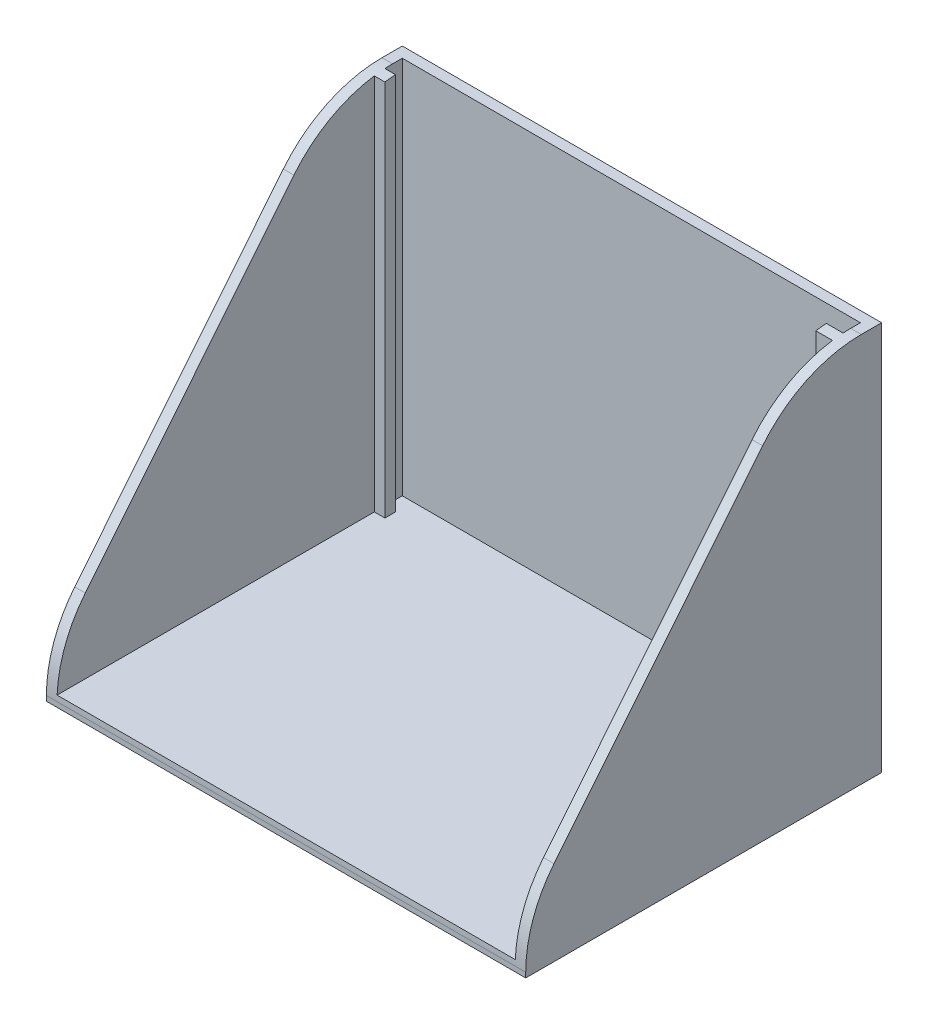
ISO-10303-21;
HEADER;
FILE_DESCRIPTION(('STEP AP214'),'2;1');
FILE_NAME('part.step','',(''),(''),'','','');
FILE_SCHEMA(('AUTOMOTIVE_DESIGN { 1 0 10303 214 1 1 1 1 }'));
ENDSEC;
DATA;
#1=APPLICATION_CONTEXT('core data for automotive mechanical design processes');
#2=APPLICATION_PROTOCOL_DEFINITION('international standard','automotive_design',2000,#1);
#3=PRODUCT_CONTEXT('',#1,'mechanical');
#4=PRODUCT('Part','Part','',(#3));
#5=PRODUCT_RELATED_PRODUCT_CATEGORY('part','',(#4));
#6=PRODUCT_DEFINITION_FORMATION('','',#4);
#7=PRODUCT_DEFINITION_CONTEXT('part definition',#1,'design');
#8=PRODUCT_DEFINITION('design','',#6,#7);
#9=PRODUCT_DEFINITION_SHAPE('','',#8);
#10=(LENGTH_UNIT() NAMED_UNIT(*) SI_UNIT(.MILLI.,.METRE.));
#11=(NAMED_UNIT(*) PLANE_ANGLE_UNIT() SI_UNIT($,.RADIAN.));
#12=(NAMED_UNIT(*) SI_UNIT($,.STERADIAN.) SOLID_ANGLE_UNIT());
#13=UNCERTAINTY_MEASURE_WITH_UNIT(LENGTH_MEASURE(1.E-05),#10,'distance_accuracy_value','');
#14=(GEOMETRIC_REPRESENTATION_CONTEXT(3) GLOBAL_UNCERTAINTY_ASSIGNED_CONTEXT((#13)) GLOBAL_UNIT_ASSIGNED_CONTEXT((#10,
#11,#12)) REPRESENTATION_CONTEXT('',''));
#15=CARTESIAN_POINT('',(0.,0.,0.));
#16=DIRECTION('',(0.,0.,1.));
#17=DIRECTION('',(1.,0.,0.));
#18=AXIS2_PLACEMENT_3D('',#15,#16,#17);
#19=CARTESIAN_POINT('',(163.524,-109.181799526008,3.104));
#20=DIRECTION('',(0.,0.,1.));
#21=DIRECTION('',(1.,0.,0.));
#22=AXIS2_PLACEMENT_3D('',#19,#20,#21);
#23=PLANE('',#22);
#24=DIRECTION('',(0.,-1.,0.));
#25=VECTOR('',#24,1.);
#26=CARTESIAN_POINT('',(108.516,-109.181799526008,3.104));
#27=LINE('',#26,#25);
#28=CARTESIAN_POINT('',(108.516,-109.33984308712,3.104));
#29=VERTEX_POINT('',#28);
#30=CARTESIAN_POINT('',(108.516,-154.681799526008,3.104));
#31=VERTEX_POINT('',#30);
#32=EDGE_CURVE('E273',#29,#31,#27,.T.);
#33=ORIENTED_EDGE('',*,*,#32,.F.);
#34=DIRECTION('',(1.,0.,0.));
#35=VECTOR('',#34,1.);
#36=CARTESIAN_POINT('',(108.516,-109.33984308712,3.104));
#37=LINE('',#36,#35);
#38=CARTESIAN_POINT('',(107.246,-109.33984308712,3.10399999999998));
#39=VERTEX_POINT('',#38);
#40=EDGE_CURVE('E316',#29,#39,#37,.F.);
#41=ORIENTED_EDGE('',*,*,#40,.T.);
#42=DIRECTION('',(0.,1.,0.));
#43=VECTOR('',#42,1.);
#44=CARTESIAN_POINT('',(107.246,-109.181799526008,3.10399999999998));
#45=LINE('',#44,#43);
#46=CARTESIAN_POINT('',(107.246,-154.681799526008,3.10399999999998));
#47=VERTEX_POINT('',#46);
#48=EDGE_CURVE('E189',#47,#39,#45,.T.);
#49=ORIENTED_EDGE('',*,*,#48,.F.);
#50=DIRECTION('',(-1.,0.,0.));
#51=VECTOR('',#50,1.);
#52=CARTESIAN_POINT('',(107.246,-154.681799526008,3.10399999999998));
#53=LINE('',#52,#51);
#54=EDGE_CURVE('E216',#31,#47,#53,.T.);
#55=ORIENTED_EDGE('',*,*,#54,.F.);
#56=EDGE_LOOP('',(#33,#41,#49,#55));
#57=FACE_BOUND('',#56,.T.);
#58=ADVANCED_FACE('F39',(#57),#23,.T.);
#59=CARTESIAN_POINT('',(162.254,-109.181799526008,-0.254));
#60=DIRECTION('',(0.,0.,1.));
#61=DIRECTION('',(1.,0.,0.));
#62=AXIS2_PLACEMENT_3D('',#59,#60,#61);
#63=PLANE('',#62);
#64=DIRECTION('',(-1.,0.,0.));
#65=VECTOR('',#64,1.);
#66=CARTESIAN_POINT('',(162.254,-154.681799526008,-0.254));
#67=LINE('',#66,#65);
#68=CARTESIAN_POINT('',(162.254,-154.681799526008,-0.254));
#69=VERTEX_POINT('',#68);
#70=CARTESIAN_POINT('',(107.246,-154.681799526008,-0.254));
#71=VERTEX_POINT('',#70);
#72=EDGE_CURVE('E228',#69,#71,#67,.T.);
#73=ORIENTED_EDGE('',*,*,#72,.F.);
#74=DIRECTION('',(0.,-1.,0.));
#75=VECTOR('',#74,1.);
#76=CARTESIAN_POINT('',(162.254,-109.181799526008,-0.254));
#77=LINE('',#76,#75);
#78=CARTESIAN_POINT('',(162.254,-109.181799526008,-0.254));
#79=VERTEX_POINT('',#78);
#80=EDGE_CURVE('E261',#79,#69,#77,.T.);
#81=ORIENTED_EDGE('',*,*,#80,.F.);
#82=DIRECTION('',(-1.,0.,0.));
#83=VECTOR('',#82,1.);
#84=CARTESIAN_POINT('',(107.246,-109.181799526008,-0.254));
#85=LINE('',#84,#83);
#86=CARTESIAN_POINT('',(107.246,-109.181799526008,-0.254));
#87=VERTEX_POINT('',#86);
#88=EDGE_CURVE('E224',#79,#87,#85,.T.);
#89=ORIENTED_EDGE('',*,*,#88,.T.);
#90=DIRECTION('',(0.,-1.,0.));
#91=VECTOR('',#90,1.);
#92=CARTESIAN_POINT('',(107.246,-109.181799526008,-0.254));
#93=LINE('',#92,#91);
#94=EDGE_CURVE('E241',#87,#71,#93,.T.);
#95=ORIENTED_EDGE('',*,*,#94,.T.);
#96=EDGE_LOOP('',(#73,#81,#89,#95));
#97=FACE_BOUND('',#96,.T.);
#98=ADVANCED_FACE('F384',(#97),#63,.T.);
#99=CARTESIAN_POINT('',(162.254,-109.181799526008,1.834));
#100=DIRECTION('',(-1.,0.,0.));
#101=DIRECTION('',(0.,-1.,0.));
#102=AXIS2_PLACEMENT_3D('',#99,#100,#101);
#103=PLANE('',#102);
#104=DIRECTION('',(0.,-1.,0.));
#105=VECTOR('',#104,1.);
#106=CARTESIAN_POINT('',(162.254,-109.181799526008,1.834));
#107=LINE('',#106,#105);
#108=CARTESIAN_POINT('',(162.254,-109.209539927084,1.834));
#109=VERTEX_POINT('',#108);
#110=CARTESIAN_POINT('',(162.254,-154.681799526008,1.834));
#111=VERTEX_POINT('',#110);
#112=EDGE_CURVE('E264',#109,#111,#107,.T.);
#113=ORIENTED_EDGE('',*,*,#112,.F.);
#114=CARTESIAN_POINT('',(162.254,-124.421799526008,0.914892881679948));
#115=DIRECTION('',(-1.,0.,0.));
#116=DIRECTION('',(0.,-1.,0.));
#117=AXIS2_PLACEMENT_3D('',#114,#115,#116);
#118=CIRCLE('',#117,15.24);
#119=CARTESIAN_POINT('',(162.254,-109.181799526008,0.914892881679948));
#120=VERTEX_POINT('',#119);
#121=EDGE_CURVE('E308',#109,#120,#118,.T.);
#122=ORIENTED_EDGE('',*,*,#121,.T.);
#123=DIRECTION('',(0.,0.,-1.));
#124=VECTOR('',#123,1.);
#125=CARTESIAN_POINT('',(162.254,-109.181799526008,1.834));
#126=LINE('',#125,#124);
#127=EDGE_CURVE('E239',#120,#79,#126,.T.);
#128=ORIENTED_EDGE('',*,*,#127,.T.);
#129=ORIENTED_EDGE('',*,*,#80,.T.);
#130=DIRECTION('',(0.,0.,-1.));
#131=VECTOR('',#130,1.);
#132=CARTESIAN_POINT('',(162.254,-154.681799526008,1.834));
#133=LINE('',#132,#131);
#134=EDGE_CURVE('E256',#111,#69,#133,.T.);
#135=ORIENTED_EDGE('',*,*,#134,.F.);
#136=EDGE_LOOP('',(#113,#122,#128,#129,#135));
#137=FACE_BOUND('',#136,.T.);
#138=ADVANCED_FACE('F388',(#137),#103,.T.);
#139=CARTESIAN_POINT('',(160.252914004423,-109.181799526008,1.834));
#140=DIRECTION('',(0.,0.,-1.));
#141=DIRECTION('',(-1.,0.,0.));
#142=AXIS2_PLACEMENT_3D('',#139,#140,#141);
#143=PLANE('',#142);
#144=DIRECTION('',(0.,-1.,0.));
#145=VECTOR('',#144,1.);
#146=CARTESIAN_POINT('',(160.252914004423,-109.181799526008,1.834));
#147=LINE('',#146,#145);
#148=CARTESIAN_POINT('',(160.252914004423,-109.209539927084,1.834));
#149=VERTEX_POINT('',#148);
#150=CARTESIAN_POINT('',(160.252914004423,-154.681799526008,1.834));
#151=VERTEX_POINT('',#150);
#152=EDGE_CURVE('E266',#149,#151,#147,.T.);
#153=ORIENTED_EDGE('',*,*,#152,.F.);
#154=DIRECTION('',(1.,0.,0.));
#155=VECTOR('',#154,1.);
#156=CARTESIAN_POINT('',(160.252914004423,-109.209539927084,1.834));
#157=LINE('',#156,#155);
#158=EDGE_CURVE('E306',#149,#109,#157,.T.);
#159=ORIENTED_EDGE('',*,*,#158,.T.);
#160=ORIENTED_EDGE('',*,*,#112,.T.);
#161=DIRECTION('',(1.,0.,0.));
#162=VECTOR('',#161,1.);
#163=CARTESIAN_POINT('',(160.252914004423,-154.681799526008,1.834));
#164=LINE('',#163,#162);
#165=EDGE_CURVE('E253',#151,#111,#164,.T.);
#166=ORIENTED_EDGE('',*,*,#165,.F.);
#167=EDGE_LOOP('',(#153,#159,#160,#166));
#168=FACE_BOUND('',#167,.T.);
#169=ADVANCED_FACE('F393',(#168),#143,.T.);
#170=CARTESIAN_POINT('',(160.252914004423,-109.181799526008,3.104));
#171=DIRECTION('',(-1.,0.,0.));
#172=DIRECTION('',(0.,-1.,0.));
#173=AXIS2_PLACEMENT_3D('',#170,#171,#172);
#174=PLANE('',#173);
#175=DIRECTION('',(0.,-1.,0.));
#176=VECTOR('',#175,1.);
#177=CARTESIAN_POINT('',(160.252914004423,-109.181799526008,3.104));
#178=LINE('',#177,#176);
#179=CARTESIAN_POINT('',(160.252914004423,-109.33984308712,3.104));
#180=VERTEX_POINT('',#179);
#181=CARTESIAN_POINT('',(160.252914004423,-154.681799526008,3.104));
#182=VERTEX_POINT('',#181);
#183=EDGE_CURVE('E268',#180,#182,#178,.T.);
#184=ORIENTED_EDGE('',*,*,#183,.F.);
#185=CARTESIAN_POINT('',(160.252914004423,-124.421799526008,0.914892881679948));
#186=DIRECTION('',(-1.,0.,0.));
#187=DIRECTION('',(0.,-1.,0.));
#188=AXIS2_PLACEMENT_3D('',#185,#186,#187);
#189=CIRCLE('',#188,15.24);
#190=EDGE_CURVE('E304',#180,#149,#189,.T.);
#191=ORIENTED_EDGE('',*,*,#190,.T.);
#192=ORIENTED_EDGE('',*,*,#152,.T.);
#193=DIRECTION('',(0.,0.,-1.));
#194=VECTOR('',#193,1.);
#195=CARTESIAN_POINT('',(160.252914004423,-154.681799526008,3.104));
#196=LINE('',#195,#194);
#197=EDGE_CURVE('E250',#182,#151,#196,.T.);
#198=ORIENTED_EDGE('',*,*,#197,.F.);
#199=EDGE_LOOP('',(#184,#191,#192,#198));
#200=FACE_BOUND('',#199,.T.);
#201=ADVANCED_FACE('F422',(#200),#174,.T.);
#202=DIRECTION('',(0.,-1.,0.));
#203=VECTOR('',#202,1.);
#204=CARTESIAN_POINT('',(162.254,-154.681799526008,3.10399999999998));
#205=LINE('',#204,#203);
#206=CARTESIAN_POINT('',(162.254,-109.33984308712,3.10399999999998));
#207=VERTEX_POINT('',#206);
#208=CARTESIAN_POINT('',(162.254,-154.681799526008,3.10399999999998));
#209=VERTEX_POINT('',#208);
#210=EDGE_CURVE('E210',#207,#209,#205,.T.);
#211=ORIENTED_EDGE('',*,*,#210,.F.);
#212=DIRECTION('',(1.,0.,0.));
#213=VECTOR('',#212,1.);
#214=CARTESIAN_POINT('',(162.254,-109.33984308712,3.10399999999998));
#215=LINE('',#214,#213);
#216=EDGE_CURVE('E302',#207,#180,#215,.F.);
#217=ORIENTED_EDGE('',*,*,#216,.T.);
#218=ORIENTED_EDGE('',*,*,#183,.T.);
#219=EDGE_CURVE('E213',#209,#182,#53,.T.);
#220=ORIENTED_EDGE('',*,*,#219,.F.);
#221=EDGE_LOOP('',(#211,#217,#218,#220));
#222=FACE_BOUND('',#221,.T.);
#223=ADVANCED_FACE('F412',(#222),#23,.T.);
#224=CARTESIAN_POINT('',(163.524,-109.181799526008,-1.524));
#225=DIRECTION('',(1.,0.,0.));
#226=DIRECTION('',(0.,1.,0.));
#227=AXIS2_PLACEMENT_3D('',#224,#225,#226);
#228=PLANE('',#227);
#229=DIRECTION('',(0.,-0.77714596145697,0.629320391049839));
#230=VECTOR('',#229,1.);
#231=CARTESIAN_POINT('',(163.524,-104.433871072046,4.33920334722932));
#232=LINE('',#231,#230);
#233=CARTESIAN_POINT('',(163.524,-114.830956766408,12.7585973342842));
#234=VERTEX_POINT('',#233);
#235=CARTESIAN_POINT('',(163.524,-145.764027920563,37.8077044526042));
#236=VERTEX_POINT('',#235);
#237=EDGE_CURVE('E282',#234,#236,#232,.T.);
#238=ORIENTED_EDGE('',*,*,#237,.T.);
#239=CARTESIAN_POINT('',(163.524,-155.354870680163,25.964));
#240=DIRECTION('',(1.,0.,0.));
#241=DIRECTION('',(0.,1.,0.));
#242=AXIS2_PLACEMENT_3D('',#239,#240,#241);
#243=CIRCLE('',#242,15.24);
#244=CARTESIAN_POINT('',(163.524,-155.354870680163,41.204));
#245=VERTEX_POINT('',#244);
#246=EDGE_CURVE('E332',#236,#245,#243,.T.);
#247=ORIENTED_EDGE('',*,*,#246,.T.);
#248=DIRECTION('',(0.,1.,0.));
#249=VECTOR('',#248,1.);
#250=CARTESIAN_POINT('',(163.524,-109.181799526008,41.204));
#251=LINE('',#250,#249);
#252=CARTESIAN_POINT('',(163.524,-155.951799526008,41.204));
#253=VERTEX_POINT('',#252);
#254=EDGE_CURVE('E205',#253,#245,#251,.T.);
#255=ORIENTED_EDGE('',*,*,#254,.F.);
#256=DIRECTION('',(0.,0.,1.));
#257=VECTOR('',#256,1.);
#258=CARTESIAN_POINT('',(163.524,-155.951799526008,3.104));
#259=LINE('',#258,#257);
#260=CARTESIAN_POINT('',(163.524,-155.951799526008,-1.524));
#261=VERTEX_POINT('',#260);
#262=EDGE_CURVE('E204',#261,#253,#259,.T.);
#263=ORIENTED_EDGE('',*,*,#262,.F.);
#264=DIRECTION('',(0.,-1.,0.));
#265=VECTOR('',#264,1.);
#266=CARTESIAN_POINT('',(163.524,-109.181799526008,-1.524));
#267=LINE('',#266,#265);
#268=CARTESIAN_POINT('',(163.524,-109.181799526008,-1.524));
#269=VERTEX_POINT('',#268);
#270=EDGE_CURVE('E270',#269,#261,#267,.T.);
#271=ORIENTED_EDGE('',*,*,#270,.F.);
#272=DIRECTION('',(0.,0.,1.));
#273=VECTOR('',#272,1.);
#274=CARTESIAN_POINT('',(163.524,-109.181799526008,-1.524));
#275=LINE('',#274,#273);
#276=CARTESIAN_POINT('',(163.524,-109.181799526008,0.914892881679948));
#277=VERTEX_POINT('',#276);
#278=EDGE_CURVE('E236',#269,#277,#275,.T.);
#279=ORIENTED_EDGE('',*,*,#278,.T.);
#280=CARTESIAN_POINT('',(163.524,-124.421799526008,0.914892881679948));
#281=DIRECTION('',(1.,0.,0.));
#282=DIRECTION('',(0.,1.,0.));
#283=AXIS2_PLACEMENT_3D('',#280,#281,#282);
#284=CIRCLE('',#283,15.24);
#285=EDGE_CURVE('E295',#277,#234,#284,.T.);
#286=ORIENTED_EDGE('',*,*,#285,.T.);
#287=EDGE_LOOP('',(#238,#247,#255,#263,#271,#279,#286));
#288=FACE_BOUND('',#287,.T.);
#289=ADVANCED_FACE('F337',(#288),#228,.T.);
#290=CARTESIAN_POINT('',(163.524,-109.181799526008,-1.524));
#291=DIRECTION('',(0.,0.,-1.));
#292=DIRECTION('',(-1.,0.,0.));
#293=AXIS2_PLACEMENT_3D('',#290,#291,#292);
#294=PLANE('',#293);
#295=ORIENTED_EDGE('',*,*,#270,.T.);
#296=DIRECTION('',(1.,0.,0.));
#297=VECTOR('',#296,1.);
#298=CARTESIAN_POINT('',(105.976,-155.951799526008,-1.524));
#299=LINE('',#298,#297);
#300=CARTESIAN_POINT('',(105.976,-155.951799526008,-1.524));
#301=VERTEX_POINT('',#300);
#302=EDGE_CURVE('E199',#301,#261,#299,.T.);
#303=ORIENTED_EDGE('',*,*,#302,.F.);
#304=DIRECTION('',(0.,-1.,0.));
#305=VECTOR('',#304,1.);
#306=CARTESIAN_POINT('',(105.976,-109.181799526008,-1.52400000000001));
#307=LINE('',#306,#305);
#308=CARTESIAN_POINT('',(105.976,-109.181799526008,-1.52400000000001));
#309=VERTEX_POINT('',#308);
#310=EDGE_CURVE('E195',#309,#301,#307,.T.);
#311=ORIENTED_EDGE('',*,*,#310,.F.);
#312=DIRECTION('',(1.,0.,0.));
#313=VECTOR('',#312,1.);
#314=CARTESIAN_POINT('',(163.524,-109.181799526008,-1.524));
#315=LINE('',#314,#313);
#316=EDGE_CURVE('E233',#309,#269,#315,.T.);
#317=ORIENTED_EDGE('',*,*,#316,.T.);
#318=EDGE_LOOP('',(#295,#303,#311,#317));
#319=FACE_BOUND('',#318,.T.);
#320=ADVANCED_FACE('F403',(#319),#294,.T.);
#321=CARTESIAN_POINT('',(105.976,-109.181799526008,-1.52400000000001));
#322=DIRECTION('',(-1.,0.,0.));
#323=DIRECTION('',(0.,-1.,0.));
#324=AXIS2_PLACEMENT_3D('',#321,#322,#323);
#325=PLANE('',#324);
#326=DIRECTION('',(0.,-1.,0.));
#327=VECTOR('',#326,1.);
#328=CARTESIAN_POINT('',(105.976,-155.951799526008,41.204));
#329=LINE('',#328,#327);
#330=CARTESIAN_POINT('',(105.976,-155.354870680163,41.204));
#331=VERTEX_POINT('',#330);
#332=CARTESIAN_POINT('',(105.976,-155.951799526008,41.204));
#333=VERTEX_POINT('',#332);
#334=EDGE_CURVE('E181',#331,#333,#329,.T.);
#335=ORIENTED_EDGE('',*,*,#334,.F.);
#336=CARTESIAN_POINT('',(105.976,-155.354870680163,25.964));
#337=DIRECTION('',(-1.,0.,0.));
#338=DIRECTION('',(0.,-1.,0.));
#339=AXIS2_PLACEMENT_3D('',#336,#337,#338);
#340=CIRCLE('',#339,15.24);
#341=CARTESIAN_POINT('',(105.976,-145.764027920564,37.8077044526042));
#342=VERTEX_POINT('',#341);
#343=EDGE_CURVE('E61',#331,#342,#340,.T.);
#344=ORIENTED_EDGE('',*,*,#343,.T.);
#345=DIRECTION('',(0.,0.77714596145697,-0.629320391049839));
#346=VECTOR('',#345,1.);
#347=CARTESIAN_POINT('',(105.976,-104.433871072046,4.33920334722933));
#348=LINE('',#347,#346);
#349=CARTESIAN_POINT('',(105.976,-114.830956766408,12.7585973342842));
#350=VERTEX_POINT('',#349);
#351=EDGE_CURVE('E285',#342,#350,#348,.T.);
#352=ORIENTED_EDGE('',*,*,#351,.T.);
#353=CARTESIAN_POINT('',(105.976,-124.421799526008,0.914892881679953));
#354=DIRECTION('',(-1.,0.,0.));
#355=DIRECTION('',(0.,-1.,0.));
#356=AXIS2_PLACEMENT_3D('',#353,#354,#355);
#357=CIRCLE('',#356,15.24);
#358=CARTESIAN_POINT('',(105.976,-109.181799526008,0.914892881679953));
#359=VERTEX_POINT('',#358);
#360=EDGE_CURVE('E323',#350,#359,#357,.T.);
#361=ORIENTED_EDGE('',*,*,#360,.T.);
#362=DIRECTION('',(0.,0.,-1.));
#363=VECTOR('',#362,1.);
#364=CARTESIAN_POINT('',(105.976,-109.181799526008,-1.52400000000001));
#365=LINE('',#364,#363);
#366=EDGE_CURVE('E231',#359,#309,#365,.T.);
#367=ORIENTED_EDGE('',*,*,#366,.T.);
#368=ORIENTED_EDGE('',*,*,#310,.T.);
#369=DIRECTION('',(0.,0.,-1.));
#370=VECTOR('',#369,1.);
#371=CARTESIAN_POINT('',(105.976,-155.951799526008,3.104));
#372=LINE('',#371,#370);
#373=EDGE_CURVE('E192',#333,#301,#372,.T.);
#374=ORIENTED_EDGE('',*,*,#373,.F.);
#375=EDGE_LOOP('',(#335,#344,#352,#361,#367,#368,#374));
#376=FACE_BOUND('',#375,.T.);
#377=ADVANCED_FACE('F193',(#376),#325,.T.);
#378=CARTESIAN_POINT('',(108.516,-109.181799526008,3.104));
#379=DIRECTION('',(1.,0.,0.));
#380=DIRECTION('',(0.,1.,0.));
#381=AXIS2_PLACEMENT_3D('',#378,#379,#380);
#382=PLANE('',#381);
#383=DIRECTION('',(0.,-1.,0.));
#384=VECTOR('',#383,1.);
#385=CARTESIAN_POINT('',(108.516,-109.181799526008,1.834));
#386=LINE('',#385,#384);
#387=CARTESIAN_POINT('',(108.516,-109.209539927084,1.834));
#388=VERTEX_POINT('',#387);
#389=CARTESIAN_POINT('',(108.516,-154.681799526008,1.834));
#390=VERTEX_POINT('',#389);
#391=EDGE_CURVE('E275',#388,#390,#386,.T.);
#392=ORIENTED_EDGE('',*,*,#391,.F.);
#393=CARTESIAN_POINT('',(108.516,-124.421799526008,0.914892881679953));
#394=DIRECTION('',(1.,0.,0.));
#395=DIRECTION('',(0.,1.,0.));
#396=AXIS2_PLACEMENT_3D('',#393,#394,#395);
#397=CIRCLE('',#396,15.24);
#398=EDGE_CURVE('E314',#388,#29,#397,.T.);
#399=ORIENTED_EDGE('',*,*,#398,.T.);
#400=ORIENTED_EDGE('',*,*,#32,.T.);
#401=DIRECTION('',(0.,0.,1.));
#402=VECTOR('',#401,1.);
#403=CARTESIAN_POINT('',(108.516,-154.681799526008,3.104));
#404=LINE('',#403,#402);
#405=EDGE_CURVE('E247',#390,#31,#404,.T.);
#406=ORIENTED_EDGE('',*,*,#405,.F.);
#407=EDGE_LOOP('',(#392,#399,#400,#406));
#408=FACE_BOUND('',#407,.T.);
#409=ADVANCED_FACE('F410',(#408),#382,.T.);
#410=CARTESIAN_POINT('',(108.516,-109.181799526008,1.834));
#411=DIRECTION('',(0.,0.,-1.));
#412=DIRECTION('',(-1.,0.,0.));
#413=AXIS2_PLACEMENT_3D('',#410,#411,#412);
#414=PLANE('',#413);
#415=DIRECTION('',(0.,-1.,0.));
#416=VECTOR('',#415,1.);
#417=CARTESIAN_POINT('',(107.246,-109.181799526008,1.834));
#418=LINE('',#417,#416);
#419=CARTESIAN_POINT('',(107.246,-109.209539927084,1.834));
#420=VERTEX_POINT('',#419);
#421=CARTESIAN_POINT('',(107.246,-154.681799526008,1.834));
#422=VERTEX_POINT('',#421);
#423=EDGE_CURVE('E277',#420,#422,#418,.T.);
#424=ORIENTED_EDGE('',*,*,#423,.F.);
#425=DIRECTION('',(1.,0.,0.));
#426=VECTOR('',#425,1.);
#427=CARTESIAN_POINT('',(107.246,-109.209539927084,1.834));
#428=LINE('',#427,#426);
#429=EDGE_CURVE('E312',#420,#388,#428,.T.);
#430=ORIENTED_EDGE('',*,*,#429,.T.);
#431=ORIENTED_EDGE('',*,*,#391,.T.);
#432=DIRECTION('',(1.,0.,0.));
#433=VECTOR('',#432,1.);
#434=CARTESIAN_POINT('',(108.516,-154.681799526008,1.834));
#435=LINE('',#434,#433);
#436=EDGE_CURVE('E244',#422,#390,#435,.T.);
#437=ORIENTED_EDGE('',*,*,#436,.F.);
#438=EDGE_LOOP('',(#424,#430,#431,#437));
#439=FACE_BOUND('',#438,.T.);
#440=ADVANCED_FACE('F379',(#439),#414,.T.);
#441=CARTESIAN_POINT('',(107.246,-109.181799526008,1.834));
#442=DIRECTION('',(1.,0.,0.));
#443=DIRECTION('',(0.,1.,0.));
#444=AXIS2_PLACEMENT_3D('',#441,#442,#443);
#445=PLANE('',#444);
#446=DIRECTION('',(0.,0.,1.));
#447=VECTOR('',#446,1.);
#448=CARTESIAN_POINT('',(107.246,-109.181799526008,1.834));
#449=LINE('',#448,#447);
#450=CARTESIAN_POINT('',(107.246,-109.181799526008,0.914892881679953));
#451=VERTEX_POINT('',#450);
#452=EDGE_CURVE('E227',#87,#451,#449,.T.);
#453=ORIENTED_EDGE('',*,*,#452,.T.);
#454=CARTESIAN_POINT('',(107.246,-124.421799526008,0.914892881679953));
#455=DIRECTION('',(1.,0.,0.));
#456=DIRECTION('',(0.,1.,0.));
#457=AXIS2_PLACEMENT_3D('',#454,#455,#456);
#458=CIRCLE('',#457,15.24);
#459=EDGE_CURVE('E310',#451,#420,#458,.T.);
#460=ORIENTED_EDGE('',*,*,#459,.T.);
#461=ORIENTED_EDGE('',*,*,#423,.T.);
#462=DIRECTION('',(0.,0.,1.));
#463=VECTOR('',#462,1.);
#464=CARTESIAN_POINT('',(107.246,-154.681799526008,1.834));
#465=LINE('',#464,#463);
#466=EDGE_CURVE('E223',#71,#422,#465,.T.);
#467=ORIENTED_EDGE('',*,*,#466,.F.);
#468=ORIENTED_EDGE('',*,*,#94,.F.);
#469=EDGE_LOOP('',(#453,#460,#461,#467,#468));
#470=FACE_BOUND('',#469,.T.);
#471=ADVANCED_FACE('F375',(#470),#445,.T.);
#472=CARTESIAN_POINT('',(0.,-109.181799526008,0.));
#473=DIRECTION('',(0.,1.,0.));
#474=DIRECTION('',(-1.,0.,0.));
#475=AXIS2_PLACEMENT_3D('',#472,#473,#474);
#476=PLANE('',#475);
#477=ORIENTED_EDGE('',*,*,#127,.F.);
#478=DIRECTION('',(1.,0.,0.));
#479=VECTOR('',#478,1.);
#480=CARTESIAN_POINT('',(0.,-109.181799526008,0.914892881679948));
#481=LINE('',#480,#479);
#482=EDGE_CURVE('E292',#120,#277,#481,.T.);
#483=ORIENTED_EDGE('',*,*,#482,.T.);
#484=ORIENTED_EDGE('',*,*,#278,.F.);
#485=ORIENTED_EDGE('',*,*,#316,.F.);
#486=ORIENTED_EDGE('',*,*,#366,.F.);
#487=DIRECTION('',(1.,0.,0.));
#488=VECTOR('',#487,1.);
#489=CARTESIAN_POINT('',(0.,-109.181799526008,0.914892881679953));
#490=LINE('',#489,#488);
#491=EDGE_CURVE('E289',#359,#451,#490,.T.);
#492=ORIENTED_EDGE('',*,*,#491,.T.);
#493=ORIENTED_EDGE('',*,*,#452,.F.);
#494=ORIENTED_EDGE('',*,*,#88,.F.);
#495=EDGE_LOOP('',(#477,#483,#484,#485,#486,#492,#493,#494));
#496=FACE_BOUND('',#495,.T.);
#497=ADVANCED_FACE('F369',(#496),#476,.T.);
#498=CARTESIAN_POINT('',(0.,-154.681799526008,0.));
#499=DIRECTION('',(0.,-1.,0.));
#500=DIRECTION('',(0.,0.,-1.));
#501=AXIS2_PLACEMENT_3D('',#498,#499,#500);
#502=PLANE('',#501);
#503=DIRECTION('',(1.,0.,0.));
#504=VECTOR('',#503,1.);
#505=CARTESIAN_POINT('',(107.246,-154.681799526008,41.1891297275736));
#506=LINE('',#505,#504);
#507=CARTESIAN_POINT('',(107.246,-154.681799526008,41.1891297275736));
#508=VERTEX_POINT('',#507);
#509=CARTESIAN_POINT('',(162.254,-154.681799526008,41.1891297275736));
#510=VERTEX_POINT('',#509);
#511=EDGE_CURVE('E326',#508,#510,#506,.T.);
#512=ORIENTED_EDGE('',*,*,#511,.T.);
#513=DIRECTION('',(0.,0.,-1.));
#514=VECTOR('',#513,1.);
#515=CARTESIAN_POINT('',(162.254,-154.681799526008,41.204));
#516=LINE('',#515,#514);
#517=EDGE_CURVE('E200',#510,#209,#516,.T.);
#518=ORIENTED_EDGE('',*,*,#517,.T.);
#519=ORIENTED_EDGE('',*,*,#219,.T.);
#520=ORIENTED_EDGE('',*,*,#197,.T.);
#521=ORIENTED_EDGE('',*,*,#165,.T.);
#522=ORIENTED_EDGE('',*,*,#134,.T.);
#523=ORIENTED_EDGE('',*,*,#72,.T.);
#524=ORIENTED_EDGE('',*,*,#466,.T.);
#525=ORIENTED_EDGE('',*,*,#436,.T.);
#526=ORIENTED_EDGE('',*,*,#405,.T.);
#527=ORIENTED_EDGE('',*,*,#54,.T.);
#528=DIRECTION('',(0.,0.,-1.));
#529=VECTOR('',#528,1.);
#530=CARTESIAN_POINT('',(107.246,-154.681799526008,41.204));
#531=LINE('',#530,#529);
#532=EDGE_CURVE('E207',#508,#47,#531,.T.);
#533=ORIENTED_EDGE('',*,*,#532,.F.);
#534=EDGE_LOOP('',(#512,#518,#519,#520,#521,#522,#523,#524,#525,#526,#527,#533));
#535=FACE_BOUND('',#534,.T.);
#536=ADVANCED_FACE('F350',(#535),#502,.F.);
#537=CARTESIAN_POINT('',(0.,-155.951799526008,0.));
#538=DIRECTION('',(0.,-1.,0.));
#539=DIRECTION('',(0.,0.,-1.));
#540=AXIS2_PLACEMENT_3D('',#537,#538,#539);
#541=PLANE('',#540);
#542=ORIENTED_EDGE('',*,*,#373,.T.);
#543=ORIENTED_EDGE('',*,*,#302,.T.);
#544=ORIENTED_EDGE('',*,*,#262,.T.);
#545=DIRECTION('',(1.,0.,0.));
#546=VECTOR('',#545,1.);
#547=CARTESIAN_POINT('',(163.524,-155.951799526008,41.204));
#548=LINE('',#547,#546);
#549=EDGE_CURVE('E186',#333,#253,#548,.T.);
#550=ORIENTED_EDGE('',*,*,#549,.F.);
#551=EDGE_LOOP('',(#542,#543,#544,#550));
#552=FACE_BOUND('',#551,.T.);
#553=ADVANCED_FACE('F202',(#552),#541,.T.);
#554=CARTESIAN_POINT('',(162.254,-154.681799526008,41.204));
#555=DIRECTION('',(1.,0.,0.));
#556=DIRECTION('',(0.,0.,-1.));
#557=AXIS2_PLACEMENT_3D('',#554,#555,#556);
#558=PLANE('',#557);
#559=ORIENTED_EDGE('',*,*,#517,.F.);
#560=CARTESIAN_POINT('',(162.254,-155.354870680163,25.964));
#561=DIRECTION('',(1.,0.,0.));
#562=DIRECTION('',(0.,0.,-1.));
#563=AXIS2_PLACEMENT_3D('',#560,#561,#562);
#564=CIRCLE('',#563,15.24);
#565=CARTESIAN_POINT('',(162.254,-145.764027920563,37.8077044526042));
#566=VERTEX_POINT('',#565);
#567=EDGE_CURVE('E328',#510,#566,#564,.F.);
#568=ORIENTED_EDGE('',*,*,#567,.T.);
#569=DIRECTION('',(0.,0.77714596145697,-0.629320391049839));
#570=VECTOR('',#569,1.);
#571=CARTESIAN_POINT('',(162.254,-149.958103634795,41.204));
#572=LINE('',#571,#570);
#573=CARTESIAN_POINT('',(162.254,-114.830956766408,12.7585973342842));
#574=VERTEX_POINT('',#573);
#575=EDGE_CURVE('E280',#566,#574,#572,.T.);
#576=ORIENTED_EDGE('',*,*,#575,.T.);
#577=CARTESIAN_POINT('',(162.254,-124.421799526008,0.914892881679948));
#578=DIRECTION('',(1.,0.,0.));
#579=DIRECTION('',(0.,0.,-1.));
#580=AXIS2_PLACEMENT_3D('',#577,#578,#579);
#581=CIRCLE('',#580,15.24);
#582=EDGE_CURVE('E300',#574,#207,#581,.F.);
#583=ORIENTED_EDGE('',*,*,#582,.T.);
#584=ORIENTED_EDGE('',*,*,#210,.T.);
#585=EDGE_LOOP('',(#559,#568,#576,#583,#584));
#586=FACE_BOUND('',#585,.T.);
#587=ADVANCED_FACE('F433',(#586),#558,.F.);
#588=CARTESIAN_POINT('',(107.246,-109.181799526008,41.204));
#589=DIRECTION('',(-1.,0.,0.));
#590=DIRECTION('',(0.,0.,1.));
#591=AXIS2_PLACEMENT_3D('',#588,#589,#590);
#592=PLANE('',#591);
#593=DIRECTION('',(0.,-0.77714596145697,0.629320391049839));
#594=VECTOR('',#593,1.);
#595=CARTESIAN_POINT('',(107.246,-149.958103634795,41.204));
#596=LINE('',#595,#594);
#597=CARTESIAN_POINT('',(107.246,-114.830956766408,12.7585973342842));
#598=VERTEX_POINT('',#597);
#599=CARTESIAN_POINT('',(107.246,-145.764027920564,37.8077044526042));
#600=VERTEX_POINT('',#599);
#601=EDGE_CURVE('E287',#598,#600,#596,.T.);
#602=ORIENTED_EDGE('',*,*,#601,.T.);
#603=CARTESIAN_POINT('',(107.246,-155.354870680163,25.964));
#604=DIRECTION('',(-1.,0.,0.));
#605=DIRECTION('',(0.,0.,1.));
#606=AXIS2_PLACEMENT_3D('',#603,#604,#605);
#607=CIRCLE('',#606,15.24);
#608=EDGE_CURVE('E11',#600,#508,#607,.F.);
#609=ORIENTED_EDGE('',*,*,#608,.T.);
#610=ORIENTED_EDGE('',*,*,#532,.T.);
#611=ORIENTED_EDGE('',*,*,#48,.T.);
#612=CARTESIAN_POINT('',(107.246,-124.421799526008,0.914892881679953));
#613=DIRECTION('',(-1.,0.,0.));
#614=DIRECTION('',(0.,0.,1.));
#615=AXIS2_PLACEMENT_3D('',#612,#613,#614);
#616=CIRCLE('',#615,15.24);
#617=EDGE_CURVE('E318',#39,#598,#616,.F.);
#618=ORIENTED_EDGE('',*,*,#617,.T.);
#619=EDGE_LOOP('',(#602,#609,#610,#611,#618));
#620=FACE_BOUND('',#619,.T.);
#621=ADVANCED_FACE('F346',(#620),#592,.F.);
#622=CARTESIAN_POINT('',(0.,0.,41.204));
#623=DIRECTION('',(0.,0.,-1.));
#624=DIRECTION('',(-1.,0.,0.));
#625=AXIS2_PLACEMENT_3D('',#622,#623,#624);
#626=PLANE('',#625);
#627=ORIENTED_EDGE('',*,*,#254,.T.);
#628=DIRECTION('',(-1.,0.,0.));
#629=VECTOR('',#628,1.);
#630=CARTESIAN_POINT('',(105.976,-155.354870680163,41.204));
#631=LINE('',#630,#629);
#632=EDGE_CURVE('E188',#245,#331,#631,.T.);
#633=ORIENTED_EDGE('',*,*,#632,.T.);
#634=ORIENTED_EDGE('',*,*,#334,.T.);
#635=ORIENTED_EDGE('',*,*,#549,.T.);
#636=EDGE_LOOP('',(#627,#633,#634,#635));
#637=FACE_BOUND('',#636,.T.);
#638=ADVANCED_FACE('F184',(#637),#626,.F.);
#639=CARTESIAN_POINT('',(1.06187075140201E-13,-149.958103634795,41.204));
#640=DIRECTION('',(0.,0.629320391049839,0.77714596145697));
#641=DIRECTION('',(1.,0.,0.));
#642=AXIS2_PLACEMENT_3D('',#639,#640,#641);
#643=PLANE('',#642);
#644=ORIENTED_EDGE('',*,*,#575,.F.);
#645=DIRECTION('',(-1.,0.,0.));
#646=VECTOR('',#645,1.);
#647=CARTESIAN_POINT('',(163.524,-145.764027920563,37.8077044526042));
#648=LINE('',#647,#646);
#649=EDGE_CURVE('E330',#566,#236,#648,.F.);
#650=ORIENTED_EDGE('',*,*,#649,.T.);
#651=ORIENTED_EDGE('',*,*,#237,.F.);
#652=DIRECTION('',(1.,0.,0.));
#653=VECTOR('',#652,1.);
#654=CARTESIAN_POINT('',(0.,-114.830956766408,12.7585973342842));
#655=LINE('',#654,#653);
#656=EDGE_CURVE('E297',#234,#574,#655,.F.);
#657=ORIENTED_EDGE('',*,*,#656,.T.);
#658=EDGE_LOOP('',(#644,#650,#651,#657));
#659=FACE_BOUND('',#658,.T.);
#660=ADVANCED_FACE('F436',(#659),#643,.T.);
#661=CARTESIAN_POINT('',(1.06187075140201E-13,-149.958103634795,41.204));
#662=DIRECTION('',(0.,0.629320391049839,0.77714596145697));
#663=DIRECTION('',(1.,0.,0.));
#664=AXIS2_PLACEMENT_3D('',#661,#662,#663);
#665=PLANE('',#664);
#666=ORIENTED_EDGE('',*,*,#351,.F.);
#667=DIRECTION('',(-1.,0.,0.));
#668=VECTOR('',#667,1.);
#669=CARTESIAN_POINT('',(107.246,-145.764027920564,37.8077044526042));
#670=LINE('',#669,#668);
#671=EDGE_CURVE('E47',#342,#600,#670,.F.);
#672=ORIENTED_EDGE('',*,*,#671,.T.);
#673=ORIENTED_EDGE('',*,*,#601,.F.);
#674=DIRECTION('',(1.,0.,0.));
#675=VECTOR('',#674,1.);
#676=CARTESIAN_POINT('',(0.,-114.830956766408,12.7585973342842));
#677=LINE('',#676,#675);
#678=EDGE_CURVE('E320',#598,#350,#677,.F.);
#679=ORIENTED_EDGE('',*,*,#678,.T.);
#680=EDGE_LOOP('',(#666,#672,#673,#679));
#681=FACE_BOUND('',#680,.T.);
#682=ADVANCED_FACE('F364',(#681),#665,.T.);
#683=CARTESIAN_POINT('',(0.,-124.421799526008,0.914892881679948));
#684=DIRECTION('',(1.,0.,0.));
#685=DIRECTION('',(0.,1.,0.));
#686=AXIS2_PLACEMENT_3D('',#683,#684,#685);
#687=CYLINDRICAL_SURFACE('',#686,15.24);
#688=ORIENTED_EDGE('',*,*,#582,.F.);
#689=ORIENTED_EDGE('',*,*,#656,.F.);
#690=ORIENTED_EDGE('',*,*,#285,.F.);
#691=ORIENTED_EDGE('',*,*,#482,.F.);
#692=ORIENTED_EDGE('',*,*,#121,.F.);
#693=ORIENTED_EDGE('',*,*,#158,.F.);
#694=ORIENTED_EDGE('',*,*,#190,.F.);
#695=ORIENTED_EDGE('',*,*,#216,.F.);
#696=EDGE_LOOP('',(#688,#689,#690,#691,#692,#693,#694,#695));
#697=FACE_BOUND('',#696,.T.);
#698=ADVANCED_FACE('F399',(#697),#687,.T.);
#699=CARTESIAN_POINT('',(0.,-124.421799526008,0.914892881679953));
#700=DIRECTION('',(1.,0.,0.));
#701=DIRECTION('',(0.,1.,0.));
#702=AXIS2_PLACEMENT_3D('',#699,#700,#701);
#703=CYLINDRICAL_SURFACE('',#702,15.24);
#704=ORIENTED_EDGE('',*,*,#360,.F.);
#705=ORIENTED_EDGE('',*,*,#678,.F.);
#706=ORIENTED_EDGE('',*,*,#617,.F.);
#707=ORIENTED_EDGE('',*,*,#40,.F.);
#708=ORIENTED_EDGE('',*,*,#398,.F.);
#709=ORIENTED_EDGE('',*,*,#429,.F.);
#710=ORIENTED_EDGE('',*,*,#459,.F.);
#711=ORIENTED_EDGE('',*,*,#491,.F.);
#712=EDGE_LOOP('',(#704,#705,#706,#707,#708,#709,#710,#711));
#713=FACE_BOUND('',#712,.T.);
#714=ADVANCED_FACE('F361',(#713),#703,.T.);
#715=CARTESIAN_POINT('',(1.10008588575422E-13,-155.354870680163,25.964));
#716=DIRECTION('',(1.,0.,0.));
#717=DIRECTION('',(0.,1.,0.));
#718=AXIS2_PLACEMENT_3D('',#715,#716,#717);
#719=CYLINDRICAL_SURFACE('',#718,15.24);
#720=ORIENTED_EDGE('',*,*,#343,.F.);
#721=ORIENTED_EDGE('',*,*,#632,.F.);
#722=ORIENTED_EDGE('',*,*,#246,.F.);
#723=ORIENTED_EDGE('',*,*,#649,.F.);
#724=ORIENTED_EDGE('',*,*,#567,.F.);
#725=ORIENTED_EDGE('',*,*,#511,.F.);
#726=ORIENTED_EDGE('',*,*,#608,.F.);
#727=ORIENTED_EDGE('',*,*,#671,.F.);
#728=EDGE_LOOP('',(#720,#721,#722,#723,#724,#725,#726,#727));
#729=FACE_BOUND('',#728,.T.);
#730=ADVANCED_FACE('F41',(#729),#719,.T.);
#731=CLOSED_SHELL('',(#58,#98,#138,#169,#201,#223,#289,#320,#377,#409,#440,#471,#497,#536,#553,
#587,#621,#638,#660,#682,#698,#714,#730));
#732=MANIFOLD_SOLID_BREP('B2',#731);
#733=ADVANCED_BREP_SHAPE_REPRESENTATION('',(#18,#732),#14);
#734=SHAPE_DEFINITION_REPRESENTATION(#9,#733);
ENDSEC;
END-ISO-10303-21;
